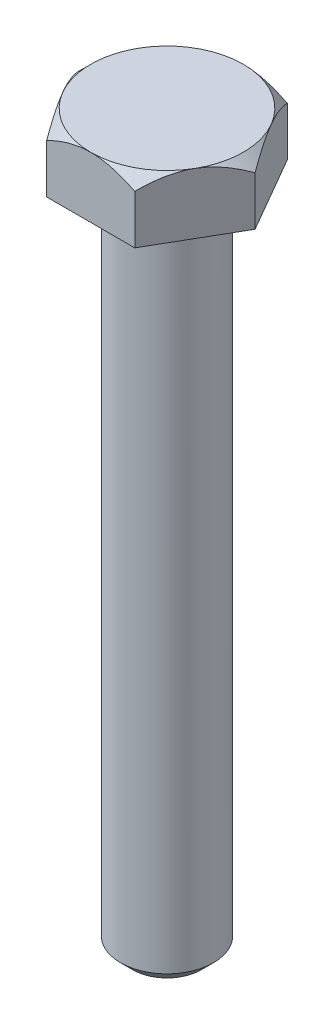
ISO-10303-21;
HEADER;
FILE_DESCRIPTION(('STEP AP214'),'2;1');
FILE_NAME('part.step','',(''),(''),'','','');
FILE_SCHEMA(('AUTOMOTIVE_DESIGN { 1 0 10303 214 1 1 1 1 }'));
ENDSEC;
DATA;
#1=APPLICATION_CONTEXT('core data for automotive mechanical design processes');
#2=APPLICATION_PROTOCOL_DEFINITION('international standard','automotive_design',2000,#1);
#3=PRODUCT_CONTEXT('',#1,'mechanical');
#4=PRODUCT('Part','Part','',(#3));
#5=PRODUCT_RELATED_PRODUCT_CATEGORY('part','',(#4));
#6=PRODUCT_DEFINITION_FORMATION('','',#4);
#7=PRODUCT_DEFINITION_CONTEXT('part definition',#1,'design');
#8=PRODUCT_DEFINITION('design','',#6,#7);
#9=PRODUCT_DEFINITION_SHAPE('','',#8);
#10=(LENGTH_UNIT() NAMED_UNIT(*) SI_UNIT(.MILLI.,.METRE.));
#11=(NAMED_UNIT(*) PLANE_ANGLE_UNIT() SI_UNIT($,.RADIAN.));
#12=(NAMED_UNIT(*) SI_UNIT($,.STERADIAN.) SOLID_ANGLE_UNIT());
#13=UNCERTAINTY_MEASURE_WITH_UNIT(LENGTH_MEASURE(1.E-05),#10,'distance_accuracy_value','');
#14=(GEOMETRIC_REPRESENTATION_CONTEXT(3) GLOBAL_UNCERTAINTY_ASSIGNED_CONTEXT((#13)) GLOBAL_UNIT_ASSIGNED_CONTEXT((#10,
#11,#12)) REPRESENTATION_CONTEXT('',''));
#15=CARTESIAN_POINT('',(0.,0.,0.));
#16=DIRECTION('',(0.,0.,1.));
#17=DIRECTION('',(1.,0.,0.));
#18=AXIS2_PLACEMENT_3D('',#15,#16,#17);
#19=CARTESIAN_POINT('',(3.62500000000007,5.,6.27868417743714));
#20=DIRECTION('',(-0.866025403784442,0.,-0.499999999999995));
#21=DIRECTION('',(-0.499999999999995,0.,0.866025403784442));
#22=AXIS2_PLACEMENT_3D('',#19,#20,#21);
#23=PLANE('',#22);
#24=CARTESIAN_POINT('',(3.62488452994624,4.02856870462476,6.27888417743714));
#25=CARTESIAN_POINT('',(3.68721389664161,4.0908916934917,6.17092654751716));
#26=CARTESIAN_POINT('',(3.75002235616352,4.15130208102734,6.06213910448007));
#27=CARTESIAN_POINT('',(3.87669145105401,4.2677158493395,5.84274179638098));
#28=CARTESIAN_POINT('',(3.94055263837515,4.32371682320785,5.73213097530909));
#29=CARTESIAN_POINT('',(4.13444955410337,4.48471046563524,5.39629166583691));
#30=CARTESIAN_POINT('',(4.26612670995196,4.58200705628878,5.16822014171098));
#31=CARTESIAN_POINT('',(4.53166422082633,4.74862075095615,4.70829568156119));
#32=CARTESIAN_POINT('',(4.66545670737727,4.81835760873348,4.47656029718399));
#33=CARTESIAN_POINT('',(4.86834501872006,4.89902600771869,4.12514743367641));
#34=CARTESIAN_POINT('',(4.93627316062514,4.92191520494596,4.00749244063306));
#35=CARTESIAN_POINT('',(5.07270459498125,4.95919667933445,3.77118626457879));
#36=CARTESIAN_POINT('',(5.14120779992591,4.97359022631844,3.65253523313333));
#37=CARTESIAN_POINT('',(5.30814078917526,4.99772308228725,3.3633988142941));
#38=CARTESIAN_POINT('',(5.40675043702598,5.0027866000747,3.19260189410018));
#39=CARTESIAN_POINT('',(5.60379200256286,4.99428769024785,2.85131589138739));
#40=CARTESIAN_POINT('',(5.70222384583931,4.98071873353769,2.68082693774991));
#41=CARTESIAN_POINT('',(5.89815953180448,4.9357547130673,2.34145637464237));
#42=CARTESIAN_POINT('',(5.99566221252046,4.9043397144273,2.17257677776813));
#43=CARTESIAN_POINT('',(6.18899174051392,4.82539152715257,1.83772021268014));
#44=CARTESIAN_POINT('',(6.28481871570106,4.77785957445157,1.67174302292037));
#45=CARTESIAN_POINT('',(6.45492849942725,4.68007191376467,1.37710423464204));
#46=CARTESIAN_POINT('',(6.52958798795453,4.63238802285783,1.2477902072457));
#47=CARTESIAN_POINT('',(6.67756674436656,4.52933616008443,0.991483482699198));
#48=CARTESIAN_POINT('',(6.75088597153632,4.47396795521828,0.864490856069481));
#49=CARTESIAN_POINT('',(6.89595327454856,4.35678861091045,0.613226916735296));
#50=CARTESIAN_POINT('',(6.96770547617939,4.29499773307909,0.488948457955774));
#51=CARTESIAN_POINT('',(7.10988123305974,4.16578428211806,0.24269282343444));
#52=CARTESIAN_POINT('',(7.18030557110013,4.09836516278837,0.120714291859081));
#53=CARTESIAN_POINT('',(7.25011547005384,4.02856870462477,-0.000200000000000499));
#54=B_SPLINE_CURVE_WITH_KNOTS('',3,(#24,#25,#26,#27,#28,#29,#30,#31,#32,#33,#34,#35,#36,#37,#38,
#39,#40,#41,#42,#43,#44,#45,#46,#47,#48,#49,#50,#51,#52,#53),.UNSPECIFIED.,.F.,.F.,(4,2,2,2,2,2,
2,2,2,2,2,2,2,2,4),(0.,0.418085081925561,0.83639681869771,1.67753646991016,2.50531966073267,
2.91839943514191,3.33141745194524,3.9223507147329,4.51349110216463,5.10529312372582,
5.69704977302065,6.16707290687592,6.63711029563191,7.10570744431351,7.57401912040438),.UNSPECIFIED.);
#55=CARTESIAN_POINT('',(3.62500000000007,4.02868417743718,6.27868417743714));
#56=VERTEX_POINT('',#55);
#57=CARTESIAN_POINT('',(5.43750000000002,5.,3.13934208871856));
#58=VERTEX_POINT('',#57);
#59=EDGE_CURVE('E109',#56,#58,#54,.T.);
#60=ORIENTED_EDGE('',*,*,#59,.F.);
#61=DIRECTION('',(0.,-1.,0.));
#62=VECTOR('',#61,1.);
#63=CARTESIAN_POINT('',(3.62500000000007,5.,6.27868417743714));
#64=LINE('',#63,#62);
#65=CARTESIAN_POINT('',(3.62500000000007,0.,6.27868417743714));
#66=VERTEX_POINT('',#65);
#67=EDGE_CURVE('E58',#56,#66,#64,.T.);
#68=ORIENTED_EDGE('',*,*,#67,.T.);
#69=DIRECTION('',(0.499999999999995,0.,-0.866025403784442));
#70=VECTOR('',#69,1.);
#71=CARTESIAN_POINT('',(3.62500000000007,0.,6.27868417743714));
#72=LINE('',#71,#70);
#73=CARTESIAN_POINT('',(7.25,0.,0.));
#74=VERTEX_POINT('',#73);
#75=EDGE_CURVE('E116',#66,#74,#72,.T.);
#76=ORIENTED_EDGE('',*,*,#75,.T.);
#77=DIRECTION('',(0.,-1.,0.));
#78=VECTOR('',#77,1.);
#79=CARTESIAN_POINT('',(7.25,5.,0.));
#80=LINE('',#79,#78);
#81=CARTESIAN_POINT('',(7.25,4.02868417743718,0.));
#82=VERTEX_POINT('',#81);
#83=EDGE_CURVE('E134',#82,#74,#80,.T.);
#84=ORIENTED_EDGE('',*,*,#83,.F.);
#85=EDGE_CURVE('E117',#58,#82,#54,.T.);
#86=ORIENTED_EDGE('',*,*,#85,.F.);
#87=EDGE_LOOP('',(#60,#68,#76,#84,#86));
#88=FACE_BOUND('',#87,.T.);
#89=ADVANCED_FACE('F35',(#88),#23,.F.);
#90=CARTESIAN_POINT('',(7.25,5.,0.));
#91=DIRECTION('',(-0.866025403784438,0.,0.500000000000001));
#92=DIRECTION('',(0.500000000000001,0.,0.866025403784438));
#93=AXIS2_PLACEMENT_3D('',#90,#91,#92);
#94=PLANE('',#93);
#95=CARTESIAN_POINT('',(7.25011547005384,4.02856870462477,0.000200000000000034));
#96=CARTESIAN_POINT('',(7.18778610335847,4.0908916934917,-0.107757629919975));
#97=CARTESIAN_POINT('',(7.12497764383655,4.15130208102734,-0.21654507295707));
#98=CARTESIAN_POINT('',(6.99830854894606,4.2677158493395,-0.435942381056166));
#99=CARTESIAN_POINT('',(6.93444736162492,4.32371682320785,-0.546553202128054));
#100=CARTESIAN_POINT('',(6.7405504458967,4.48471046563526,-0.882392511600232));
#101=CARTESIAN_POINT('',(6.6088732900481,4.58200705628879,-1.11046403572617));
#102=CARTESIAN_POINT('',(6.34333577917372,4.74862075095617,-1.57038849587596));
#103=CARTESIAN_POINT('',(6.20954329262278,4.8183576087335,-1.80212388025316));
#104=CARTESIAN_POINT('',(6.00665498127998,4.89902600771871,-2.15353674376074));
#105=CARTESIAN_POINT('',(5.9387268393749,4.92191520494598,-2.27119173680409));
#106=CARTESIAN_POINT('',(5.80229540501879,4.95919667933447,-2.50749791285837));
#107=CARTESIAN_POINT('',(5.73379220007413,4.97359022631846,-2.62614894430383));
#108=CARTESIAN_POINT('',(5.56685921082478,4.99772308228727,-2.91528536314305));
#109=CARTESIAN_POINT('',(5.46824956297406,5.00278660007473,-3.08608228333698));
#110=CARTESIAN_POINT('',(5.27120799743718,4.99428769024788,-3.42736828604976));
#111=CARTESIAN_POINT('',(5.17277615416072,4.98071873353772,-3.59785723968724));
#112=CARTESIAN_POINT('',(4.97684046819555,4.93575471306732,-3.93722780279478));
#113=CARTESIAN_POINT('',(4.87933778747957,4.90433971442733,-4.10610739966901));
#114=CARTESIAN_POINT('',(4.68600825948611,4.8253915271526,-4.44096396475701));
#115=CARTESIAN_POINT('',(4.59018128429897,4.7778595744516,-4.60694115451677));
#116=CARTESIAN_POINT('',(4.42007150057277,4.68007191376469,-4.9015799427951));
#117=CARTESIAN_POINT('',(4.34541201204549,4.63238802285786,-5.03089397019145));
#118=CARTESIAN_POINT('',(4.19743325563346,4.52933616008445,-5.28720069473796));
#119=CARTESIAN_POINT('',(4.12411402846369,4.4739679552183,-5.41419332136768));
#120=CARTESIAN_POINT('',(3.97904672545145,4.35678861091046,-5.66545726070187));
#121=CARTESIAN_POINT('',(3.90729452382061,4.2949977330791,-5.7897357194814));
#122=CARTESIAN_POINT('',(3.76511876694025,4.16578428211807,-6.03599135400274));
#123=CARTESIAN_POINT('',(3.69469442889986,4.09836516278837,-6.1579698855781));
#124=CARTESIAN_POINT('',(3.62488452994615,4.02856870462476,-6.27888417743719));
#125=B_SPLINE_CURVE_WITH_KNOTS('',3,(#95,#96,#97,#98,#99,#100,#101,#102,#103,#104,#105,#106,
#107,#108,#109,#110,#111,#112,#113,#114,#115,#116,#117,#118,#119,#120,#121,#122,#123,#124),
.UNSPECIFIED.,.F.,.F.,(4,2,2,2,2,2,2,2,2,2,2,2,2,2,4),(0.,0.418085081925567,0.83639681869772,
1.67753646991019,2.5053196607327,2.91839943514195,3.33141745194528,3.92235071473293,
4.51349110216466,5.10529312372585,5.69704977302068,6.16707290687597,6.63711029563198,
7.1057074443136,7.57401912040448),.UNSPECIFIED.);
#126=CARTESIAN_POINT('',(5.43749999999999,5.,-3.13934208871859));
#127=VERTEX_POINT('',#126);
#128=EDGE_CURVE('E124',#82,#127,#125,.T.);
#129=ORIENTED_EDGE('',*,*,#128,.F.);
#130=ORIENTED_EDGE('',*,*,#83,.T.);
#131=DIRECTION('',(-0.500000000000001,0.,-0.866025403784438));
#132=VECTOR('',#131,1.);
#133=CARTESIAN_POINT('',(7.25,0.,0.));
#134=LINE('',#133,#132);
#135=CARTESIAN_POINT('',(3.62499999999999,0.,-6.27868417743719));
#136=VERTEX_POINT('',#135);
#137=EDGE_CURVE('E397',#74,#136,#134,.T.);
#138=ORIENTED_EDGE('',*,*,#137,.T.);
#139=DIRECTION('',(0.,-1.,0.));
#140=VECTOR('',#139,1.);
#141=CARTESIAN_POINT('',(3.62499999999999,5.,-6.27868417743719));
#142=LINE('',#141,#140);
#143=CARTESIAN_POINT('',(3.62499999999999,4.02868417743718,-6.27868417743719));
#144=VERTEX_POINT('',#143);
#145=EDGE_CURVE('E203',#144,#136,#142,.T.);
#146=ORIENTED_EDGE('',*,*,#145,.F.);
#147=EDGE_CURVE('E135',#127,#144,#125,.T.);
#148=ORIENTED_EDGE('',*,*,#147,.F.);
#149=EDGE_LOOP('',(#129,#130,#138,#146,#148));
#150=FACE_BOUND('',#149,.T.);
#151=ADVANCED_FACE('F191',(#150),#94,.F.);
#152=CARTESIAN_POINT('',(3.62499999999999,5.,-6.27868417743719));
#153=DIRECTION('',(0.,0.,1.));
#154=DIRECTION('',(1.,0.,0.));
#155=AXIS2_PLACEMENT_3D('',#152,#153,#154);
#156=PLANE('',#155);
#157=CARTESIAN_POINT('',(-7.57666051860033,1.43857952280487,-6.27868417743715));
#158=CARTESIAN_POINT('',(-7.39365651230783,1.57945688959872,-6.27868417743715));
#159=CARTESIAN_POINT('',(-7.20966776392706,1.71907512434262,-6.27868417743715));
#160=CARTESIAN_POINT('',(-6.83931781583867,1.99521769306877,-6.27868417743715));
#161=CARTESIAN_POINT('',(-6.65295606622731,2.13174128876494,-6.27868417743715));
#162=CARTESIAN_POINT('',(-6.27609540777261,2.40209046760801,-6.27868417743715));
#163=CARTESIAN_POINT('',(-6.08557567548029,2.53588711812094,-6.27868417743715));
#164=CARTESIAN_POINT('',(-5.7013676758548,2.79883528544532,-6.27868417743716));
#165=CARTESIAN_POINT('',(-5.50767962786199,2.92798712185071,-6.27868417743716));
#166=CARTESIAN_POINT('',(-5.10415932230891,3.18862292545138,-6.27868417743716));
#167=CARTESIAN_POINT('',(-4.89408397797518,3.31973242959604,-6.27868417743716));
#168=CARTESIAN_POINT('',(-4.46899924146733,3.57382963916996,-6.27868417743716));
#169=CARTESIAN_POINT('',(-4.25398902548427,3.69681597506302,-6.27868417743716));
#170=CARTESIAN_POINT('',(-3.81897305439861,3.93204888921299,-6.27868417743716));
#171=CARTESIAN_POINT('',(-3.59898447967616,4.04432699068524,-6.27868417743716));
#172=CARTESIAN_POINT('',(-3.15278127156474,4.25562782816849,-6.27868417743717));
#173=CARTESIAN_POINT('',(-2.92656964053751,4.35465682564157,-6.27868417743717));
#174=CARTESIAN_POINT('',(-2.49021164331831,4.52687246842811,-6.27868417743717));
#175=CARTESIAN_POINT('',(-2.28069897147736,4.60164844585029,-6.27868417743717));
#176=CARTESIAN_POINT('',(-1.85632597962451,4.73443118921241,-6.27868417743717));
#177=CARTESIAN_POINT('',(-1.64146532079161,4.79243688972169,-6.27868417743717));
#178=CARTESIAN_POINT('',(-1.21142765694939,4.8875683886695,-6.27868417743717));
#179=CARTESIAN_POINT('',(-0.996336148218653,4.9250741683904,-6.27868417743717));
#180=CARTESIAN_POINT('',(-0.56346815275014,4.97842167925469,-6.27868417743717));
#181=CARTESIAN_POINT('',(-0.345692236177016,4.99426793349426,-6.27868417743717));
#182=CARTESIAN_POINT('',(0.0807362217716663,5.0029407360174,-6.27868417743718));
#183=CARTESIAN_POINT('',(0.289368982497101,4.99674859993676,-6.27868417743718));
#184=CARTESIAN_POINT('',(0.705011615215947,4.96394190845027,-6.27868417743718));
#185=CARTESIAN_POINT('',(0.912021338466265,4.9373255028629,-6.27868417743718));
#186=CARTESIAN_POINT('',(1.3264284221839,4.86472465401487,-6.27868417743718));
#187=CARTESIAN_POINT('',(1.53376477368789,4.81839783409703,-6.27868417743718));
#188=CARTESIAN_POINT('',(1.94386969783723,4.70894974197332,-6.27868417743718));
#189=CARTESIAN_POINT('',(2.14663852486609,4.64582940758558,-6.27868417743718));
#190=CARTESIAN_POINT('',(2.55855272468635,4.5016094654899,-6.27868417743719));
#191=CARTESIAN_POINT('',(2.76740928890636,4.41969434988626,-6.27868417743719));
#192=CARTESIAN_POINT('',(3.17975166734441,4.24320663783212,-6.27868417743719));
#193=CARTESIAN_POINT('',(3.38323501259331,4.14862833983322,-6.27868417743719));
#194=CARTESIAN_POINT('',(3.78579095692702,3.94905699505205,-6.27868417743719));
#195=CARTESIAN_POINT('',(3.98484753290937,3.84403189037483,-6.27868417743719));
#196=CARTESIAN_POINT('',(4.37839993765141,3.62587782327072,-6.27868417743719));
#197=CARTESIAN_POINT('',(4.57289646186356,3.51275010738356,-6.27868417743719));
#198=CARTESIAN_POINT('',(4.94842033299621,3.28571869098054,-6.27868417743719));
#199=CARTESIAN_POINT('',(5.12963857253774,3.17212907012057,-6.27868417743719));
#200=CARTESIAN_POINT('',(5.48896153359933,2.94011331347926,-6.2786841774372));
#201=CARTESIAN_POINT('',(5.66706602033122,2.82168681520702,-6.2786841774372));
#202=CARTESIAN_POINT('',(6.01913728036014,2.5818234603211,-6.2786841774372));
#203=CARTESIAN_POINT('',(6.19312579011556,2.46041839375126,-6.2786841774372));
#204=CARTESIAN_POINT('',(6.5387156854476,2.2143526316317,-6.2786841774372));
#205=CARTESIAN_POINT('',(6.71031771587599,2.08969284280949,-6.2786841774372));
#206=CARTESIAN_POINT('',(6.88091860823282,1.96370076934005,-6.2786841774372));
#207=B_SPLINE_CURVE_WITH_KNOTS('',3,(#157,#158,#159,#160,#161,#162,#163,#164,#165,#166,#167,
#168,#169,#170,#171,#172,#173,#174,#175,#176,#177,#178,#179,#180,#181,#182,#183,#184,#185,#186,
#187,#188,#189,#190,#191,#192,#193,#194,#195,#196,#197,#198,#199,#200,#201,#202,#203,#204,#205,
#206),.UNSPECIFIED.,.F.,.F.,(4,2,2,2,2,2,2,2,2,2,2,2,2,2,2,2,2,2,2,2,2,2,2,2,4),(0.,
0.692856158772512,1.38587590819399,2.0842410666755,2.78255808072084,3.52530650890354,
4.26817984375935,5.00879403011467,5.74905696003691,6.41585238613356,7.08269016503529,
7.73670784074358,8.39058891895184,9.01572562815278,9.64091897355062,10.2774464921539,
10.9139384719306,11.586461232698,12.2592878189047,12.9342468231889,13.6091022110665,
14.2506381722582,14.8922223007264,15.5286570401769,16.1649163294069),.UNSPECIFIED.);
#208=CARTESIAN_POINT('',(0.,5.,-6.27868417743718));
#209=VERTEX_POINT('',#208);
#210=EDGE_CURVE('E185',#144,#209,#207,.F.);
#211=ORIENTED_EDGE('',*,*,#210,.F.);
#212=ORIENTED_EDGE('',*,*,#145,.T.);
#213=DIRECTION('',(-1.,0.,0.));
#214=VECTOR('',#213,1.);
#215=CARTESIAN_POINT('',(3.62499999999999,0.,-6.27868417743719));
#216=LINE('',#215,#214);
#217=CARTESIAN_POINT('',(-3.62500000000003,0.,-6.27868417743716));
#218=VERTEX_POINT('',#217);
#219=EDGE_CURVE('E221',#136,#218,#216,.T.);
#220=ORIENTED_EDGE('',*,*,#219,.T.);
#221=DIRECTION('',(0.,-1.,0.));
#222=VECTOR('',#221,1.);
#223=CARTESIAN_POINT('',(-3.62500000000003,5.,-6.27868417743716));
#224=LINE('',#223,#222);
#225=CARTESIAN_POINT('',(-3.62500000000003,4.02868417743718,-6.27868417743716));
#226=VERTEX_POINT('',#225);
#227=EDGE_CURVE('E219',#226,#218,#224,.T.);
#228=ORIENTED_EDGE('',*,*,#227,.F.);
#229=EDGE_CURVE('E180',#209,#226,#207,.F.);
#230=ORIENTED_EDGE('',*,*,#229,.F.);
#231=EDGE_LOOP('',(#211,#212,#220,#228,#230));
#232=FACE_BOUND('',#231,.T.);
#233=ADVANCED_FACE('F187',(#232),#156,.F.);
#234=CARTESIAN_POINT('',(-3.62500000000003,5.,-6.27868417743716));
#235=DIRECTION('',(0.866025403784442,0.,0.499999999999995));
#236=DIRECTION('',(0.499999999999995,0.,-0.866025403784442));
#237=AXIS2_PLACEMENT_3D('',#234,#235,#236);
#238=PLANE('',#237);
#239=CARTESIAN_POINT('',(-3.62488452994619,4.02856870462477,-6.27888417743716));
#240=CARTESIAN_POINT('',(-3.68721389664156,4.0908916934917,-6.17092654751719));
#241=CARTESIAN_POINT('',(-3.75002235616348,4.15130208102734,-6.06213910448009));
#242=CARTESIAN_POINT('',(-3.87669145105397,4.2677158493395,-5.842741796381));
#243=CARTESIAN_POINT('',(-3.94055263837511,4.32371682320785,-5.73213097530911));
#244=CARTESIAN_POINT('',(-4.13444955410333,4.48471046563526,-5.39629166583693));
#245=CARTESIAN_POINT('',(-4.26612670995192,4.58200705628879,-5.16822014171099));
#246=CARTESIAN_POINT('',(-4.5316642208263,4.74862075095617,-4.7082956815612));
#247=CARTESIAN_POINT('',(-4.66545670737723,4.8183576087335,-4.476560297184));
#248=CARTESIAN_POINT('',(-4.86834501872003,4.89902600771871,-4.12514743367642));
#249=CARTESIAN_POINT('',(-4.93627316062511,4.92191520494598,-4.00749244063306));
#250=CARTESIAN_POINT('',(-5.07270459498122,4.95919667933447,-3.77118626457879));
#251=CARTESIAN_POINT('',(-5.14120779992588,4.97359022631847,-3.65253523313333));
#252=CARTESIAN_POINT('',(-5.30814078917523,4.99772308228727,-3.3633988142941));
#253=CARTESIAN_POINT('',(-5.40675043702595,5.00278660007473,-3.19260189410018));
#254=CARTESIAN_POINT('',(-5.60379200256283,4.99428769024788,-2.85131589138739));
#255=CARTESIAN_POINT('',(-5.70222384583928,4.98071873353772,-2.68082693774991));
#256=CARTESIAN_POINT('',(-5.89815953180445,4.93575471306732,-2.34145637464237));
#257=CARTESIAN_POINT('',(-5.99566221252043,4.90433971442733,-2.17257677776813));
#258=CARTESIAN_POINT('',(-6.18899174051389,4.8253915271526,-1.83772021268014));
#259=CARTESIAN_POINT('',(-6.28481871570103,4.7778595744516,-1.67174302292038));
#260=CARTESIAN_POINT('',(-6.45492849942722,4.68007191376469,-1.37710423464204));
#261=CARTESIAN_POINT('',(-6.5295879879545,4.63238802285786,-1.24779020724569));
#262=CARTESIAN_POINT('',(-6.67756674436654,4.52933616008446,-0.991483482699183));
#263=CARTESIAN_POINT('',(-6.7508859715363,4.4739679552183,-0.864490856069462));
#264=CARTESIAN_POINT('',(-6.89595327454855,4.35678861091046,-0.613226916735267));
#265=CARTESIAN_POINT('',(-6.96770547617938,4.2949977330791,-0.488948457955741));
#266=CARTESIAN_POINT('',(-7.10988123305973,4.16578428211807,-0.242692823434398));
#267=CARTESIAN_POINT('',(-7.18030557110012,4.09836516278837,-0.120714291859035));
#268=CARTESIAN_POINT('',(-7.25011547005384,4.02856870462476,0.000200000000050344));
#269=B_SPLINE_CURVE_WITH_KNOTS('',3,(#239,#240,#241,#242,#243,#244,#245,#246,#247,#248,#249,
#250,#251,#252,#253,#254,#255,#256,#257,#258,#259,#260,#261,#262,#263,#264,#265,#266,#267,#268),
.UNSPECIFIED.,.F.,.F.,(4,2,2,2,2,2,2,2,2,2,2,2,2,2,4),(0.,0.418085081925566,0.836396818697719,
1.67753646991018,2.5053196607327,2.91839943514195,3.33141745194527,3.92235071473293,
4.51349110216466,5.10529312372584,5.69704977302067,6.16707290687597,6.63711029563198,
7.1057074443136,7.57401912040448),.UNSPECIFIED.);
#270=CARTESIAN_POINT('',(-5.43750000000001,5.,-3.13934208871856));
#271=VERTEX_POINT('',#270);
#272=EDGE_CURVE('E186',#226,#271,#269,.T.);
#273=ORIENTED_EDGE('',*,*,#272,.F.);
#274=ORIENTED_EDGE('',*,*,#227,.T.);
#275=DIRECTION('',(-0.499999999999995,0.,0.866025403784441));
#276=VECTOR('',#275,1.);
#277=CARTESIAN_POINT('',(-3.62500000000003,0.,-6.27868417743716));
#278=LINE('',#277,#276);
#279=CARTESIAN_POINT('',(-7.25,0.,0.));
#280=VERTEX_POINT('',#279);
#281=EDGE_CURVE('E395',#218,#280,#278,.T.);
#282=ORIENTED_EDGE('',*,*,#281,.T.);
#283=DIRECTION('',(0.,-1.,0.));
#284=VECTOR('',#283,1.);
#285=CARTESIAN_POINT('',(-7.25,5.,0.));
#286=LINE('',#285,#284);
#287=CARTESIAN_POINT('',(-7.25,4.02868417743718,0.));
#288=VERTEX_POINT('',#287);
#289=EDGE_CURVE('E225',#288,#280,#286,.T.);
#290=ORIENTED_EDGE('',*,*,#289,.F.);
#291=EDGE_CURVE('E175',#271,#288,#269,.T.);
#292=ORIENTED_EDGE('',*,*,#291,.F.);
#293=EDGE_LOOP('',(#273,#274,#282,#290,#292));
#294=FACE_BOUND('',#293,.T.);
#295=ADVANCED_FACE('F190',(#294),#238,.F.);
#296=CARTESIAN_POINT('',(-7.25,5.,0.));
#297=DIRECTION('',(0.866025403784435,0.,-0.500000000000007));
#298=DIRECTION('',(-0.500000000000007,0.,-0.866025403784435));
#299=AXIS2_PLACEMENT_3D('',#296,#297,#298);
#300=PLANE('',#299);
#301=CARTESIAN_POINT('',(-7.25011547005384,4.02856870462477,-0.000199999999949406));
#302=CARTESIAN_POINT('',(-7.18778610335847,4.0908916934917,0.107757629920025));
#303=CARTESIAN_POINT('',(-7.12497764383655,4.15130208102734,0.216545072957119));
#304=CARTESIAN_POINT('',(-6.99830854894605,4.2677158493395,0.435942381056215));
#305=CARTESIAN_POINT('',(-6.93444736162491,4.32371682320785,0.546553202128102));
#306=CARTESIAN_POINT('',(-6.74055044589669,4.48471046563525,0.882392511600279));
#307=CARTESIAN_POINT('',(-6.60887329004809,4.58200705628879,1.11046403572621));
#308=CARTESIAN_POINT('',(-6.34333577917371,4.74862075095617,1.570388495876));
#309=CARTESIAN_POINT('',(-6.20954329262277,4.8183576087335,1.8021238802532));
#310=CARTESIAN_POINT('',(-6.00665498127997,4.89902600771871,2.15353674376078));
#311=CARTESIAN_POINT('',(-5.93872683937489,4.92191520494598,2.27119173680413));
#312=CARTESIAN_POINT('',(-5.80229540501878,4.95919667933447,2.50749791285841));
#313=CARTESIAN_POINT('',(-5.73379220007411,4.97359022631847,2.62614894430387));
#314=CARTESIAN_POINT('',(-5.56685921082476,4.99772308228727,2.91528536314309));
#315=CARTESIAN_POINT('',(-5.46824956297404,5.00278660007473,3.08608228333701));
#316=CARTESIAN_POINT('',(-5.27120799743715,4.99428769024788,3.4273682860498));
#317=CARTESIAN_POINT('',(-5.1727761541607,4.98071873353772,3.59785723968728));
#318=CARTESIAN_POINT('',(-4.97684046819552,4.93575471306732,3.93722780279481));
#319=CARTESIAN_POINT('',(-4.87933778747955,4.90433971442733,4.10610739966905));
#320=CARTESIAN_POINT('',(-4.68600825948608,4.8253915271526,4.44096396475704));
#321=CARTESIAN_POINT('',(-4.59018128429894,4.7778595744516,4.6069411545168));
#322=CARTESIAN_POINT('',(-4.42007150057274,4.68007191376469,4.90157994279513));
#323=CARTESIAN_POINT('',(-4.34541201204546,4.63238802285786,5.03089397019148));
#324=CARTESIAN_POINT('',(-4.19743325563342,4.52933616008446,5.28720069473799));
#325=CARTESIAN_POINT('',(-4.12411402846365,4.4739679552183,5.41419332136771));
#326=CARTESIAN_POINT('',(-3.9790467254514,4.35678861091047,5.6654572607019));
#327=CARTESIAN_POINT('',(-3.90729452382057,4.2949977330791,5.78973571948143));
#328=CARTESIAN_POINT('',(-3.76511876694021,4.16578428211807,6.03599135400277));
#329=CARTESIAN_POINT('',(-3.69469442889982,4.09836516278837,6.15796988557813));
#330=CARTESIAN_POINT('',(-3.6248845299461,4.02856870462477,6.27888417743721));
#331=B_SPLINE_CURVE_WITH_KNOTS('',3,(#301,#302,#303,#304,#305,#306,#307,#308,#309,#310,#311,
#312,#313,#314,#315,#316,#317,#318,#319,#320,#321,#322,#323,#324,#325,#326,#327,#328,#329,#330),
.UNSPECIFIED.,.F.,.F.,(4,2,2,2,2,2,2,2,2,2,2,2,2,2,4),(0.,0.418085081925566,0.836396818697719,
1.67753646991019,2.50531966073269,2.91839943514195,3.33141745194527,3.92235071473293,
4.51349110216466,5.10529312372585,5.69704977302068,6.16707290687597,6.63711029563198,
7.1057074443136,7.57401912040449),.UNSPECIFIED.);
#332=CARTESIAN_POINT('',(-5.43749999999997,5.,3.13934208871863));
#333=VERTEX_POINT('',#332);
#334=EDGE_CURVE('E380',#288,#333,#331,.T.);
#335=ORIENTED_EDGE('',*,*,#334,.F.);
#336=ORIENTED_EDGE('',*,*,#289,.T.);
#337=DIRECTION('',(0.500000000000007,0.,0.866025403784434));
#338=VECTOR('',#337,1.);
#339=CARTESIAN_POINT('',(-7.25,0.,0.));
#340=LINE('',#339,#338);
#341=CARTESIAN_POINT('',(-3.62499999999994,0.,6.27868417743721));
#342=VERTEX_POINT('',#341);
#343=EDGE_CURVE('E388',#280,#342,#340,.T.);
#344=ORIENTED_EDGE('',*,*,#343,.T.);
#345=DIRECTION('',(0.,-1.,0.));
#346=VECTOR('',#345,1.);
#347=CARTESIAN_POINT('',(-3.62499999999994,5.,6.27868417743721));
#348=LINE('',#347,#346);
#349=CARTESIAN_POINT('',(-3.62499999999994,4.02868417743718,6.27868417743721));
#350=VERTEX_POINT('',#349);
#351=EDGE_CURVE('E228',#350,#342,#348,.T.);
#352=ORIENTED_EDGE('',*,*,#351,.F.);
#353=EDGE_CURVE('E168',#333,#350,#331,.T.);
#354=ORIENTED_EDGE('',*,*,#353,.F.);
#355=EDGE_LOOP('',(#335,#336,#344,#352,#354));
#356=FACE_BOUND('',#355,.T.);
#357=ADVANCED_FACE('F308',(#356),#300,.F.);
#358=CARTESIAN_POINT('',(-3.62499999999994,5.,6.27868417743721));
#359=DIRECTION('',(0.,0.,-1.));
#360=DIRECTION('',(-1.,0.,0.));
#361=AXIS2_PLACEMENT_3D('',#358,#359,#360);
#362=PLANE('',#361);
#363=CARTESIAN_POINT('',(-7.57666051860024,1.43857952280487,6.27868417743725));
#364=CARTESIAN_POINT('',(-7.39365651230774,1.57945688959872,6.27868417743725));
#365=CARTESIAN_POINT('',(-7.20966776392697,1.71907512434262,6.27868417743725));
#366=CARTESIAN_POINT('',(-6.83931781583858,1.99521769306878,6.27868417743725));
#367=CARTESIAN_POINT('',(-6.65295606622722,2.13174128876494,6.27868417743725));
#368=CARTESIAN_POINT('',(-6.27609540777252,2.40209046760801,6.27868417743724));
#369=CARTESIAN_POINT('',(-6.0855756754802,2.53588711812094,6.27868417743724));
#370=CARTESIAN_POINT('',(-5.70136767585471,2.79883528544532,6.27868417743724));
#371=CARTESIAN_POINT('',(-5.50767962786191,2.92798712185071,6.27868417743723));
#372=CARTESIAN_POINT('',(-5.10415932230883,3.18862292545138,6.27868417743723));
#373=CARTESIAN_POINT('',(-4.89408397797509,3.31973242959604,6.27868417743723));
#374=CARTESIAN_POINT('',(-4.46899924146725,3.57382963916996,6.27868417743722));
#375=CARTESIAN_POINT('',(-4.25398902548418,3.69681597506302,6.27868417743722));
#376=CARTESIAN_POINT('',(-3.81897305439853,3.93204888921299,6.27868417743722));
#377=CARTESIAN_POINT('',(-3.59898447967608,4.04432699068524,6.27868417743721));
#378=CARTESIAN_POINT('',(-3.15278127156466,4.25562782816848,6.27868417743721));
#379=CARTESIAN_POINT('',(-2.92656964053743,4.35465682564157,6.27868417743721));
#380=CARTESIAN_POINT('',(-2.49021164331822,4.52687246842811,6.2786841774372));
#381=CARTESIAN_POINT('',(-2.28069897147728,4.60164844585029,6.2786841774372));
#382=CARTESIAN_POINT('',(-1.85632597962443,4.73443118921241,6.2786841774372));
#383=CARTESIAN_POINT('',(-1.64146532079152,4.79243688972169,6.27868417743719));
#384=CARTESIAN_POINT('',(-1.2114276569493,4.8875683886695,6.27868417743719));
#385=CARTESIAN_POINT('',(-0.996336148218567,4.9250741683904,6.27868417743719));
#386=CARTESIAN_POINT('',(-0.563468152750053,4.97842167925468,6.27868417743718));
#387=CARTESIAN_POINT('',(-0.345692236176929,4.99426793349426,6.27868417743718));
#388=CARTESIAN_POINT('',(0.0807362217717539,5.00294073601741,6.27868417743718));
#389=CARTESIAN_POINT('',(0.289368982497189,4.99674859993676,6.27868417743717));
#390=CARTESIAN_POINT('',(0.705011615216036,4.96394190845027,6.27868417743717));
#391=CARTESIAN_POINT('',(0.912021338466354,4.9373255028629,6.27868417743717));
#392=CARTESIAN_POINT('',(1.32642842218399,4.86472465401487,6.27868417743716));
#393=CARTESIAN_POINT('',(1.53376477368798,4.81839783409703,6.27868417743716));
#394=CARTESIAN_POINT('',(1.94386969783732,4.70894974197332,6.27868417743716));
#395=CARTESIAN_POINT('',(2.14663852486618,4.64582940758559,6.27868417743715));
#396=CARTESIAN_POINT('',(2.55855272468644,4.5016094654899,6.27868417743715));
#397=CARTESIAN_POINT('',(2.76740928890645,4.41969434988626,6.27868417743715));
#398=CARTESIAN_POINT('',(3.1797516673445,4.24320663783212,6.27868417743714));
#399=CARTESIAN_POINT('',(3.3832350125934,4.14862833983321,6.27868417743714));
#400=CARTESIAN_POINT('',(3.78579095692711,3.94905699505205,6.27868417743714));
#401=CARTESIAN_POINT('',(3.98484753290946,3.84403189037483,6.27868417743714));
#402=CARTESIAN_POINT('',(4.3783999376515,3.62587782327071,6.27868417743713));
#403=CARTESIAN_POINT('',(4.57289646186365,3.51275010738355,6.27868417743713));
#404=CARTESIAN_POINT('',(4.9484203329963,3.28571869098054,6.27868417743713));
#405=CARTESIAN_POINT('',(5.12963857253784,3.17212907012056,6.27868417743712));
#406=CARTESIAN_POINT('',(5.48896153359942,2.94011331347926,6.27868417743712));
#407=CARTESIAN_POINT('',(5.66706602033131,2.82168681520701,6.27868417743712));
#408=CARTESIAN_POINT('',(6.01913728036024,2.58182346032109,6.27868417743711));
#409=CARTESIAN_POINT('',(6.19312579011566,2.46041839375125,6.27868417743711));
#410=CARTESIAN_POINT('',(6.5387156854477,2.21435263163169,6.27868417743711));
#411=CARTESIAN_POINT('',(6.71031771587608,2.08969284280948,6.27868417743711));
#412=CARTESIAN_POINT('',(6.88091860823291,1.96370076934005,6.27868417743711));
#413=B_SPLINE_CURVE_WITH_KNOTS('',3,(#363,#364,#365,#366,#367,#368,#369,#370,#371,#372,#373,
#374,#375,#376,#377,#378,#379,#380,#381,#382,#383,#384,#385,#386,#387,#388,#389,#390,#391,#392,
#393,#394,#395,#396,#397,#398,#399,#400,#401,#402,#403,#404,#405,#406,#407,#408,#409,#410,#411,
#412),.UNSPECIFIED.,.F.,.F.,(4,2,2,2,2,2,2,2,2,2,2,2,2,2,2,2,2,2,2,2,2,2,2,2,4),(0.,
0.692856158772512,1.38587590819398,2.0842410666755,2.78255808072084,3.52530650890354,
4.26817984375935,5.00879403011467,5.7490569600369,6.41585238613355,7.08269016503529,
7.73670784074358,8.39058891895183,9.01572562815278,9.64091897355062,10.2774464921539,
10.9139384719306,11.586461232698,12.2592878189047,12.9342468231889,13.6091022110665,
14.2506381722582,14.8922223007265,15.5286570401769,16.1649163294069),.UNSPECIFIED.);
#414=CARTESIAN_POINT('',(0.,5.,6.27868417743717));
#415=VERTEX_POINT('',#414);
#416=EDGE_CURVE('E382',#350,#415,#413,.T.);
#417=ORIENTED_EDGE('',*,*,#416,.F.);
#418=ORIENTED_EDGE('',*,*,#351,.T.);
#419=DIRECTION('',(1.,0.,0.));
#420=VECTOR('',#419,1.);
#421=CARTESIAN_POINT('',(-3.62499999999994,0.,6.27868417743721));
#422=LINE('',#421,#420);
#423=EDGE_CURVE('E390',#342,#66,#422,.T.);
#424=ORIENTED_EDGE('',*,*,#423,.T.);
#425=ORIENTED_EDGE('',*,*,#67,.F.);
#426=EDGE_CURVE('E114',#415,#56,#413,.T.);
#427=ORIENTED_EDGE('',*,*,#426,.F.);
#428=EDGE_LOOP('',(#417,#418,#424,#425,#427));
#429=FACE_BOUND('',#428,.T.);
#430=ADVANCED_FACE('F301',(#429),#362,.F.);
#431=CARTESIAN_POINT('',(0.,0.,0.));
#432=DIRECTION('',(0.,1.,0.));
#433=DIRECTION('',(0.,0.,1.));
#434=AXIS2_PLACEMENT_3D('',#431,#432,#433);
#435=PLANE('',#434);
#436=CARTESIAN_POINT('',(0.,0.,0.));
#437=DIRECTION('',(0.,1.,0.));
#438=DIRECTION('',(0.,0.,1.));
#439=AXIS2_PLACEMENT_3D('',#436,#437,#438);
#440=CIRCLE('',#439,4.825);
#441=CARTESIAN_POINT('',(0.,0.,4.825));
#442=VERTEX_POINT('',#441);
#443=EDGE_CURVE('E235',#442,#442,#440,.T.);
#444=ORIENTED_EDGE('',*,*,#443,.T.);
#445=EDGE_LOOP('',(#444));
#446=FACE_BOUND('',#445,.T.);
#447=ORIENTED_EDGE('',*,*,#75,.F.);
#448=ORIENTED_EDGE('',*,*,#423,.F.);
#449=ORIENTED_EDGE('',*,*,#343,.F.);
#450=ORIENTED_EDGE('',*,*,#281,.F.);
#451=ORIENTED_EDGE('',*,*,#219,.F.);
#452=ORIENTED_EDGE('',*,*,#137,.F.);
#453=EDGE_LOOP('',(#447,#448,#449,#450,#451,#452));
#454=FACE_BOUND('',#453,.T.);
#455=ADVANCED_FACE('F294',(#446,#454),#435,.F.);
#456=CARTESIAN_POINT('',(0.,5.,0.));
#457=DIRECTION('',(0.,-1.,0.));
#458=DIRECTION('',(0.,0.,1.));
#459=AXIS2_PLACEMENT_3D('',#456,#457,#458);
#460=CONICAL_SURFACE('',#459,6.27868417743718,0.78539816339745);
#461=ORIENTED_EDGE('',*,*,#353,.T.);
#462=ORIENTED_EDGE('',*,*,#416,.T.);
#463=CARTESIAN_POINT('',(0.,5.,0.));
#464=DIRECTION('',(0.,1.,0.));
#465=DIRECTION('',(0.,0.,1.));
#466=AXIS2_PLACEMENT_3D('',#463,#464,#465);
#467=CIRCLE('',#466,6.27868417743718);
#468=EDGE_CURVE('E50',#333,#415,#467,.T.);
#469=ORIENTED_EDGE('',*,*,#468,.F.);
#470=EDGE_LOOP('',(#461,#462,#469));
#471=FACE_BOUND('',#470,.T.);
#472=ADVANCED_FACE('F154',(#471),#460,.T.);
#473=ORIENTED_EDGE('',*,*,#291,.T.);
#474=ORIENTED_EDGE('',*,*,#334,.T.);
#475=EDGE_CURVE('E216',#271,#333,#467,.T.);
#476=ORIENTED_EDGE('',*,*,#475,.F.);
#477=EDGE_LOOP('',(#473,#474,#476));
#478=FACE_BOUND('',#477,.T.);
#479=ADVANCED_FACE('F282',(#478),#460,.T.);
#480=ORIENTED_EDGE('',*,*,#229,.T.);
#481=ORIENTED_EDGE('',*,*,#272,.T.);
#482=EDGE_CURVE('E211',#209,#271,#467,.T.);
#483=ORIENTED_EDGE('',*,*,#482,.F.);
#484=EDGE_LOOP('',(#480,#481,#483));
#485=FACE_BOUND('',#484,.T.);
#486=ADVANCED_FACE('F212',(#485),#460,.T.);
#487=ORIENTED_EDGE('',*,*,#147,.T.);
#488=ORIENTED_EDGE('',*,*,#210,.T.);
#489=EDGE_CURVE('E129',#127,#209,#467,.T.);
#490=ORIENTED_EDGE('',*,*,#489,.F.);
#491=EDGE_LOOP('',(#487,#488,#490));
#492=FACE_BOUND('',#491,.T.);
#493=ADVANCED_FACE('F207',(#492),#460,.T.);
#494=ORIENTED_EDGE('',*,*,#85,.T.);
#495=ORIENTED_EDGE('',*,*,#128,.T.);
#496=EDGE_CURVE('E121',#58,#127,#467,.T.);
#497=ORIENTED_EDGE('',*,*,#496,.F.);
#498=EDGE_LOOP('',(#494,#495,#497));
#499=FACE_BOUND('',#498,.T.);
#500=ADVANCED_FACE('F122',(#499),#460,.T.);
#501=ORIENTED_EDGE('',*,*,#59,.T.);
#502=CARTESIAN_POINT('',(0.,5.,0.));
#503=DIRECTION('',(0.,1.,0.));
#504=DIRECTION('',(0.,0.,1.));
#505=AXIS2_PLACEMENT_3D('',#502,#503,#504);
#506=CIRCLE('',#505,6.27868417743718);
#507=EDGE_CURVE('E112',#415,#58,#506,.T.);
#508=ORIENTED_EDGE('',*,*,#507,.F.);
#509=ORIENTED_EDGE('',*,*,#426,.T.);
#510=EDGE_LOOP('',(#501,#508,#509));
#511=FACE_BOUND('',#510,.T.);
#512=ADVANCED_FACE('F111',(#511),#460,.T.);
#513=CARTESIAN_POINT('',(0.,5.,0.));
#514=DIRECTION('',(0.,1.,0.));
#515=DIRECTION('',(0.,0.,1.));
#516=AXIS2_PLACEMENT_3D('',#513,#514,#515);
#517=PLANE('',#516);
#518=ORIENTED_EDGE('',*,*,#468,.T.);
#519=ORIENTED_EDGE('',*,*,#507,.T.);
#520=ORIENTED_EDGE('',*,*,#496,.T.);
#521=ORIENTED_EDGE('',*,*,#489,.T.);
#522=ORIENTED_EDGE('',*,*,#482,.T.);
#523=ORIENTED_EDGE('',*,*,#475,.T.);
#524=EDGE_LOOP('',(#518,#519,#520,#521,#522,#523));
#525=FACE_BOUND('',#524,.T.);
#526=ADVANCED_FACE('F131',(#525),#517,.T.);
#527=CARTESIAN_POINT('',(0.,-55.,0.));
#528=DIRECTION('',(0.,1.,0.));
#529=DIRECTION('',(0.,0.,1.));
#530=AXIS2_PLACEMENT_3D('',#527,#528,#529);
#531=CYLINDRICAL_SURFACE('',#530,3.825);
#532=CARTESIAN_POINT('',(0.,-54.,0.));
#533=DIRECTION('',(0.,-1.,0.));
#534=DIRECTION('',(0.,0.,-1.));
#535=AXIS2_PLACEMENT_3D('',#532,#533,#534);
#536=CIRCLE('',#535,3.825);
#537=CARTESIAN_POINT('',(0.,-54.,-3.825));
#538=VERTEX_POINT('',#537);
#539=EDGE_CURVE('E12',#538,#538,#536,.F.);
#540=ORIENTED_EDGE('',*,*,#539,.T.);
#541=EDGE_LOOP('',(#540));
#542=FACE_BOUND('',#541,.T.);
#543=CARTESIAN_POINT('',(0.,-1.,0.));
#544=DIRECTION('',(0.,1.,0.));
#545=DIRECTION('',(0.,0.,1.));
#546=AXIS2_PLACEMENT_3D('',#543,#544,#545);
#547=CIRCLE('',#546,3.825);
#548=CARTESIAN_POINT('',(0.,-1.,3.825));
#549=VERTEX_POINT('',#548);
#550=EDGE_CURVE('E128',#549,#549,#547,.F.);
#551=ORIENTED_EDGE('',*,*,#550,.T.);
#552=EDGE_LOOP('',(#551));
#553=FACE_BOUND('',#552,.T.);
#554=ADVANCED_FACE('F155',(#542,#553),#531,.T.);
#555=CARTESIAN_POINT('',(0.,-55.,0.));
#556=DIRECTION('',(0.,-1.,0.));
#557=DIRECTION('',(0.,0.,-1.));
#558=AXIS2_PLACEMENT_3D('',#555,#556,#557);
#559=PLANE('',#558);
#560=CARTESIAN_POINT('',(0.,-55.,0.));
#561=DIRECTION('',(0.,-1.,0.));
#562=DIRECTION('',(0.,0.,-1.));
#563=AXIS2_PLACEMENT_3D('',#560,#561,#562);
#564=CIRCLE('',#563,2.82499999999999);
#565=CARTESIAN_POINT('',(0.,-55.,-2.82499999999999));
#566=VERTEX_POINT('',#565);
#567=EDGE_CURVE('E43',#566,#566,#564,.T.);
#568=ORIENTED_EDGE('',*,*,#567,.T.);
#569=EDGE_LOOP('',(#568));
#570=FACE_BOUND('',#569,.T.);
#571=ADVANCED_FACE('F240',(#570),#559,.T.);
#572=CARTESIAN_POINT('',(0.,-1.,0.));
#573=DIRECTION('',(0.,1.,0.));
#574=DIRECTION('',(0.,0.,1.));
#575=AXIS2_PLACEMENT_3D('',#572,#573,#574);
#576=TOROIDAL_SURFACE('',#575,4.825,1.);
#577=ORIENTED_EDGE('',*,*,#443,.F.);
#578=EDGE_LOOP('',(#577));
#579=FACE_BOUND('',#578,.T.);
#580=ORIENTED_EDGE('',*,*,#550,.F.);
#581=EDGE_LOOP('',(#580));
#582=FACE_BOUND('',#581,.T.);
#583=ADVANCED_FACE('F243',(#579,#582),#576,.F.);
#584=CARTESIAN_POINT('',(0.,-55.,0.));
#585=DIRECTION('',(0.,1.,0.));
#586=DIRECTION('',(0.,0.,1.));
#587=AXIS2_PLACEMENT_3D('',#584,#585,#586);
#588=CONICAL_SURFACE('',#587,2.82499999999999,0.785398163397447);
#589=ORIENTED_EDGE('',*,*,#539,.F.);
#590=EDGE_LOOP('',(#589));
#591=FACE_BOUND('',#590,.T.);
#592=ORIENTED_EDGE('',*,*,#567,.F.);
#593=EDGE_LOOP('',(#592));
#594=FACE_BOUND('',#593,.T.);
#595=ADVANCED_FACE('F37',(#591,#594),#588,.T.);
#596=CLOSED_SHELL('',(#89,#151,#233,#295,#357,#430,#455,#472,#479,#486,#493,#500,#512,#526,#554,
#571,#583,#595));
#597=MANIFOLD_SOLID_BREP('B2',#596);
#598=ADVANCED_BREP_SHAPE_REPRESENTATION('',(#18,#597),#14);
#599=SHAPE_DEFINITION_REPRESENTATION(#9,#598);
ENDSEC;
END-ISO-10303-21;
